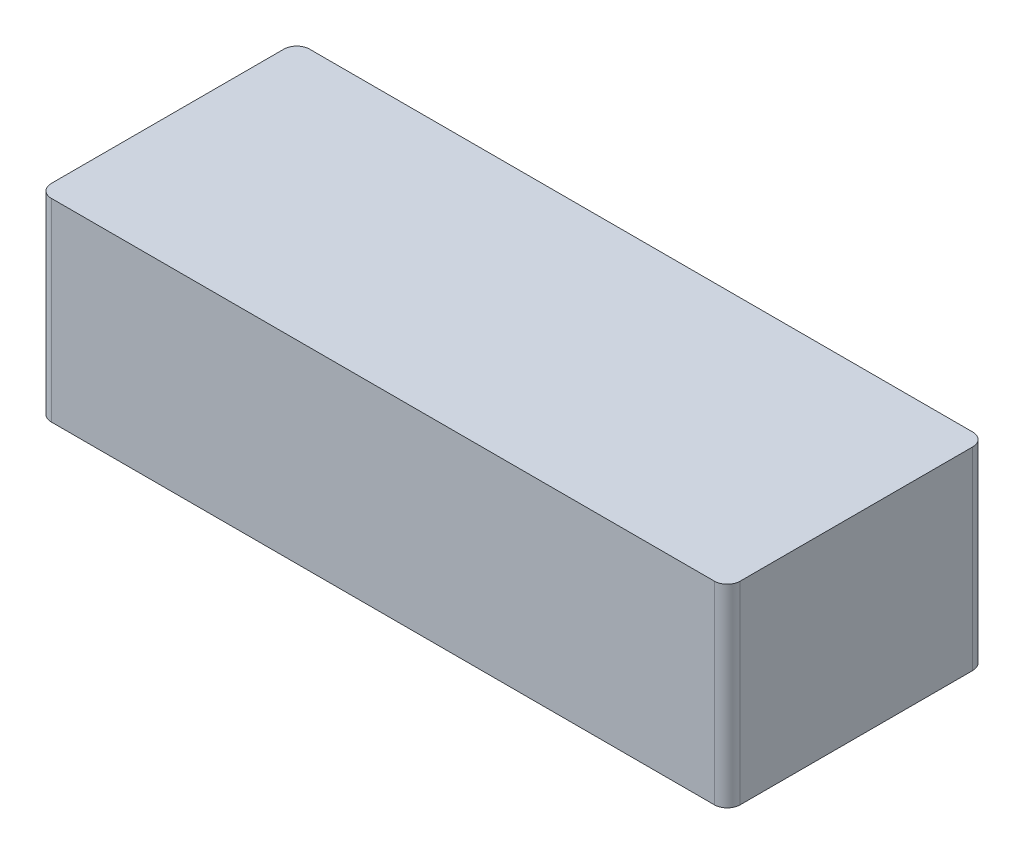
ISO-10303-21;
HEADER;
FILE_DESCRIPTION(('STEP AP214'),'2;1');
FILE_NAME('part.step','',(''),(''),'','','');
FILE_SCHEMA(('AUTOMOTIVE_DESIGN { 1 0 10303 214 1 1 1 1 }'));
ENDSEC;
DATA;
#1=APPLICATION_CONTEXT('core data for automotive mechanical design processes');
#2=APPLICATION_PROTOCOL_DEFINITION('international standard','automotive_design',2000,#1);
#3=PRODUCT_CONTEXT('',#1,'mechanical');
#4=PRODUCT('Part','Part','',(#3));
#5=PRODUCT_RELATED_PRODUCT_CATEGORY('part','',(#4));
#6=PRODUCT_DEFINITION_FORMATION('','',#4);
#7=PRODUCT_DEFINITION_CONTEXT('part definition',#1,'design');
#8=PRODUCT_DEFINITION('design','',#6,#7);
#9=PRODUCT_DEFINITION_SHAPE('','',#8);
#10=(LENGTH_UNIT() NAMED_UNIT(*) SI_UNIT(.MILLI.,.METRE.));
#11=(NAMED_UNIT(*) PLANE_ANGLE_UNIT() SI_UNIT($,.RADIAN.));
#12=(NAMED_UNIT(*) SI_UNIT($,.STERADIAN.) SOLID_ANGLE_UNIT());
#13=UNCERTAINTY_MEASURE_WITH_UNIT(LENGTH_MEASURE(1.E-05),#10,'distance_accuracy_value','');
#14=(GEOMETRIC_REPRESENTATION_CONTEXT(3) GLOBAL_UNCERTAINTY_ASSIGNED_CONTEXT((#13)) GLOBAL_UNIT_ASSIGNED_CONTEXT((#10,
#11,#12)) REPRESENTATION_CONTEXT('',''));
#15=CARTESIAN_POINT('',(0.,0.,0.));
#16=DIRECTION('',(0.,0.,1.));
#17=DIRECTION('',(1.,0.,0.));
#18=AXIS2_PLACEMENT_3D('',#15,#16,#17);
#19=CARTESIAN_POINT('',(-154.,90.,-60.));
#20=DIRECTION('',(0.,0.,-1.));
#21=DIRECTION('',(-1.,0.,0.));
#22=AXIS2_PLACEMENT_3D('',#19,#20,#21);
#23=PLANE('',#22);
#24=DIRECTION('',(1.,0.,0.));
#25=VECTOR('',#24,1.);
#26=CARTESIAN_POINT('',(-154.,0.,-60.));
#27=LINE('',#26,#25);
#28=CARTESIAN_POINT('',(-154.,0.,-60.));
#29=VERTEX_POINT('',#28);
#30=CARTESIAN_POINT('',(154.,0.,-60.));
#31=VERTEX_POINT('',#30);
#32=EDGE_CURVE('E136',#29,#31,#27,.T.);
#33=ORIENTED_EDGE('',*,*,#32,.F.);
#34=DIRECTION('',(0.,-1.,0.));
#35=VECTOR('',#34,1.);
#36=CARTESIAN_POINT('',(-154.,90.,-60.));
#37=LINE('',#36,#35);
#38=CARTESIAN_POINT('',(-154.,90.,-60.));
#39=VERTEX_POINT('',#38);
#40=EDGE_CURVE('E11',#39,#29,#37,.T.);
#41=ORIENTED_EDGE('',*,*,#40,.F.);
#42=DIRECTION('',(1.,0.,0.));
#43=VECTOR('',#42,1.);
#44=CARTESIAN_POINT('',(-154.,90.,-60.));
#45=LINE('',#44,#43);
#46=CARTESIAN_POINT('',(154.,90.,-60.));
#47=VERTEX_POINT('',#46);
#48=EDGE_CURVE('E155',#39,#47,#45,.T.);
#49=ORIENTED_EDGE('',*,*,#48,.T.);
#50=DIRECTION('',(0.,-1.,0.));
#51=VECTOR('',#50,1.);
#52=CARTESIAN_POINT('',(154.,90.,-60.));
#53=LINE('',#52,#51);
#54=EDGE_CURVE('E39',#47,#31,#53,.T.);
#55=ORIENTED_EDGE('',*,*,#54,.T.);
#56=EDGE_LOOP('',(#33,#41,#49,#55));
#57=FACE_BOUND('',#56,.T.);
#58=ADVANCED_FACE('F36',(#57),#23,.T.);
#59=CARTESIAN_POINT('',(-154.,90.,-54.));
#60=DIRECTION('',(0.,-1.,0.));
#61=DIRECTION('',(0.,0.,-1.));
#62=AXIS2_PLACEMENT_3D('',#59,#60,#61);
#63=CYLINDRICAL_SURFACE('',#62,6.);
#64=CARTESIAN_POINT('',(-154.,0.,-54.));
#65=DIRECTION('',(0.,-1.,0.));
#66=DIRECTION('',(0.,0.,-1.));
#67=AXIS2_PLACEMENT_3D('',#64,#65,#66);
#68=CIRCLE('',#67,6.);
#69=CARTESIAN_POINT('',(-160.,0.,-54.));
#70=VERTEX_POINT('',#69);
#71=EDGE_CURVE('E153',#70,#29,#68,.T.);
#72=ORIENTED_EDGE('',*,*,#71,.F.);
#73=DIRECTION('',(0.,-1.,0.));
#74=VECTOR('',#73,1.);
#75=CARTESIAN_POINT('',(-160.,90.,-54.));
#76=LINE('',#75,#74);
#77=CARTESIAN_POINT('',(-160.,90.,-54.));
#78=VERTEX_POINT('',#77);
#79=EDGE_CURVE('E45',#78,#70,#76,.T.);
#80=ORIENTED_EDGE('',*,*,#79,.F.);
#81=CARTESIAN_POINT('',(-154.,90.,-54.));
#82=DIRECTION('',(0.,-1.,0.));
#83=DIRECTION('',(0.,0.,-1.));
#84=AXIS2_PLACEMENT_3D('',#81,#82,#83);
#85=CIRCLE('',#84,6.);
#86=EDGE_CURVE('E125',#78,#39,#85,.T.);
#87=ORIENTED_EDGE('',*,*,#86,.T.);
#88=ORIENTED_EDGE('',*,*,#40,.T.);
#89=EDGE_LOOP('',(#72,#80,#87,#88));
#90=FACE_BOUND('',#89,.T.);
#91=ADVANCED_FACE('F170',(#90),#63,.T.);
#92=CARTESIAN_POINT('',(-160.,90.,54.));
#93=DIRECTION('',(-1.,0.,0.));
#94=DIRECTION('',(0.,0.,1.));
#95=AXIS2_PLACEMENT_3D('',#92,#93,#94);
#96=PLANE('',#95);
#97=DIRECTION('',(0.,0.,-1.));
#98=VECTOR('',#97,1.);
#99=CARTESIAN_POINT('',(-160.,0.,54.));
#100=LINE('',#99,#98);
#101=CARTESIAN_POINT('',(-160.,0.,54.));
#102=VERTEX_POINT('',#101);
#103=EDGE_CURVE('E114',#102,#70,#100,.T.);
#104=ORIENTED_EDGE('',*,*,#103,.F.);
#105=DIRECTION('',(0.,-1.,0.));
#106=VECTOR('',#105,1.);
#107=CARTESIAN_POINT('',(-160.,90.,54.));
#108=LINE('',#107,#106);
#109=CARTESIAN_POINT('',(-160.,90.,54.));
#110=VERTEX_POINT('',#109);
#111=EDGE_CURVE('E109',#110,#102,#108,.T.);
#112=ORIENTED_EDGE('',*,*,#111,.F.);
#113=DIRECTION('',(0.,0.,-1.));
#114=VECTOR('',#113,1.);
#115=CARTESIAN_POINT('',(-160.,90.,54.));
#116=LINE('',#115,#114);
#117=EDGE_CURVE('E112',#110,#78,#116,.T.);
#118=ORIENTED_EDGE('',*,*,#117,.T.);
#119=ORIENTED_EDGE('',*,*,#79,.T.);
#120=EDGE_LOOP('',(#104,#112,#118,#119));
#121=FACE_BOUND('',#120,.T.);
#122=ADVANCED_FACE('F111',(#121),#96,.T.);
#123=CARTESIAN_POINT('',(-154.,90.,54.));
#124=DIRECTION('',(0.,-1.,0.));
#125=DIRECTION('',(0.,0.,-1.));
#126=AXIS2_PLACEMENT_3D('',#123,#124,#125);
#127=CYLINDRICAL_SURFACE('',#126,6.);
#128=CARTESIAN_POINT('',(-154.,0.,54.));
#129=DIRECTION('',(0.,-1.,0.));
#130=DIRECTION('',(0.,0.,-1.));
#131=AXIS2_PLACEMENT_3D('',#128,#129,#130);
#132=CIRCLE('',#131,6.);
#133=CARTESIAN_POINT('',(-154.,0.,60.));
#134=VERTEX_POINT('',#133);
#135=EDGE_CURVE('E150',#134,#102,#132,.T.);
#136=ORIENTED_EDGE('',*,*,#135,.F.);
#137=DIRECTION('',(0.,-1.,0.));
#138=VECTOR('',#137,1.);
#139=CARTESIAN_POINT('',(-154.,90.,60.));
#140=LINE('',#139,#138);
#141=CARTESIAN_POINT('',(-154.,90.,60.));
#142=VERTEX_POINT('',#141);
#143=EDGE_CURVE('E119',#142,#134,#140,.T.);
#144=ORIENTED_EDGE('',*,*,#143,.F.);
#145=CARTESIAN_POINT('',(-154.,90.,54.));
#146=DIRECTION('',(0.,-1.,0.));
#147=DIRECTION('',(0.,0.,-1.));
#148=AXIS2_PLACEMENT_3D('',#145,#146,#147);
#149=CIRCLE('',#148,6.);
#150=EDGE_CURVE('E124',#142,#110,#149,.T.);
#151=ORIENTED_EDGE('',*,*,#150,.T.);
#152=ORIENTED_EDGE('',*,*,#111,.T.);
#153=EDGE_LOOP('',(#136,#144,#151,#152));
#154=FACE_BOUND('',#153,.T.);
#155=ADVANCED_FACE('F127',(#154),#127,.T.);
#156=CARTESIAN_POINT('',(-154.,90.,60.));
#157=DIRECTION('',(0.,0.,-1.));
#158=DIRECTION('',(-1.,0.,0.));
#159=AXIS2_PLACEMENT_3D('',#156,#157,#158);
#160=PLANE('',#159);
#161=DIRECTION('',(1.,0.,0.));
#162=VECTOR('',#161,1.);
#163=CARTESIAN_POINT('',(-154.,0.,60.));
#164=LINE('',#163,#162);
#165=CARTESIAN_POINT('',(154.,0.,60.));
#166=VERTEX_POINT('',#165);
#167=EDGE_CURVE('E148',#134,#166,#164,.T.);
#168=ORIENTED_EDGE('',*,*,#167,.T.);
#169=DIRECTION('',(0.,-1.,0.));
#170=VECTOR('',#169,1.);
#171=CARTESIAN_POINT('',(154.,90.,60.));
#172=LINE('',#171,#170);
#173=CARTESIAN_POINT('',(154.,90.,60.));
#174=VERTEX_POINT('',#173);
#175=EDGE_CURVE('E159',#174,#166,#172,.T.);
#176=ORIENTED_EDGE('',*,*,#175,.F.);
#177=DIRECTION('',(1.,0.,0.));
#178=VECTOR('',#177,1.);
#179=CARTESIAN_POINT('',(-154.,90.,60.));
#180=LINE('',#179,#178);
#181=EDGE_CURVE('E129',#142,#174,#180,.T.);
#182=ORIENTED_EDGE('',*,*,#181,.F.);
#183=ORIENTED_EDGE('',*,*,#143,.T.);
#184=EDGE_LOOP('',(#168,#176,#182,#183));
#185=FACE_BOUND('',#184,.T.);
#186=ADVANCED_FACE('F183',(#185),#160,.F.);
#187=CARTESIAN_POINT('',(154.,90.,54.));
#188=DIRECTION('',(0.,-1.,0.));
#189=DIRECTION('',(0.,0.,-1.));
#190=AXIS2_PLACEMENT_3D('',#187,#188,#189);
#191=CYLINDRICAL_SURFACE('',#190,6.);
#192=CARTESIAN_POINT('',(154.,0.,54.));
#193=DIRECTION('',(0.,1.,0.));
#194=DIRECTION('',(0.,0.,1.));
#195=AXIS2_PLACEMENT_3D('',#192,#193,#194);
#196=CIRCLE('',#195,6.);
#197=CARTESIAN_POINT('',(160.,0.,54.));
#198=VERTEX_POINT('',#197);
#199=EDGE_CURVE('E146',#166,#198,#196,.T.);
#200=ORIENTED_EDGE('',*,*,#199,.T.);
#201=DIRECTION('',(0.,-1.,0.));
#202=VECTOR('',#201,1.);
#203=CARTESIAN_POINT('',(160.,90.,54.));
#204=LINE('',#203,#202);
#205=CARTESIAN_POINT('',(160.,90.,54.));
#206=VERTEX_POINT('',#205);
#207=EDGE_CURVE('E162',#206,#198,#204,.T.);
#208=ORIENTED_EDGE('',*,*,#207,.F.);
#209=CARTESIAN_POINT('',(154.,90.,54.));
#210=DIRECTION('',(0.,1.,0.));
#211=DIRECTION('',(0.,0.,1.));
#212=AXIS2_PLACEMENT_3D('',#209,#210,#211);
#213=CIRCLE('',#212,6.);
#214=EDGE_CURVE('E131',#174,#206,#213,.T.);
#215=ORIENTED_EDGE('',*,*,#214,.F.);
#216=ORIENTED_EDGE('',*,*,#175,.T.);
#217=EDGE_LOOP('',(#200,#208,#215,#216));
#218=FACE_BOUND('',#217,.T.);
#219=ADVANCED_FACE('F186',(#218),#191,.T.);
#220=CARTESIAN_POINT('',(160.,90.,54.));
#221=DIRECTION('',(-1.,0.,0.));
#222=DIRECTION('',(0.,0.,1.));
#223=AXIS2_PLACEMENT_3D('',#220,#221,#222);
#224=PLANE('',#223);
#225=DIRECTION('',(0.,0.,-1.));
#226=VECTOR('',#225,1.);
#227=CARTESIAN_POINT('',(160.,0.,54.));
#228=LINE('',#227,#226);
#229=CARTESIAN_POINT('',(160.,0.,-54.));
#230=VERTEX_POINT('',#229);
#231=EDGE_CURVE('E143',#198,#230,#228,.T.);
#232=ORIENTED_EDGE('',*,*,#231,.T.);
#233=DIRECTION('',(0.,-1.,0.));
#234=VECTOR('',#233,1.);
#235=CARTESIAN_POINT('',(160.,90.,-54.));
#236=LINE('',#235,#234);
#237=CARTESIAN_POINT('',(160.,90.,-54.));
#238=VERTEX_POINT('',#237);
#239=EDGE_CURVE('E164',#238,#230,#236,.T.);
#240=ORIENTED_EDGE('',*,*,#239,.F.);
#241=DIRECTION('',(0.,0.,-1.));
#242=VECTOR('',#241,1.);
#243=CARTESIAN_POINT('',(160.,90.,54.));
#244=LINE('',#243,#242);
#245=EDGE_CURVE('E328',#206,#238,#244,.T.);
#246=ORIENTED_EDGE('',*,*,#245,.F.);
#247=ORIENTED_EDGE('',*,*,#207,.T.);
#248=EDGE_LOOP('',(#232,#240,#246,#247));
#249=FACE_BOUND('',#248,.T.);
#250=ADVANCED_FACE('F190',(#249),#224,.F.);
#251=CARTESIAN_POINT('',(154.,90.,-54.));
#252=DIRECTION('',(0.,-1.,0.));
#253=DIRECTION('',(0.,0.,-1.));
#254=AXIS2_PLACEMENT_3D('',#251,#252,#253);
#255=CYLINDRICAL_SURFACE('',#254,6.);
#256=CARTESIAN_POINT('',(154.,0.,-54.));
#257=DIRECTION('',(0.,-1.,0.));
#258=DIRECTION('',(0.,0.,-1.));
#259=AXIS2_PLACEMENT_3D('',#256,#257,#258);
#260=CIRCLE('',#259,6.);
#261=EDGE_CURVE('E139',#31,#230,#260,.T.);
#262=ORIENTED_EDGE('',*,*,#261,.F.);
#263=ORIENTED_EDGE('',*,*,#54,.F.);
#264=CARTESIAN_POINT('',(154.,90.,-54.));
#265=DIRECTION('',(0.,-1.,0.));
#266=DIRECTION('',(0.,0.,-1.));
#267=AXIS2_PLACEMENT_3D('',#264,#265,#266);
#268=CIRCLE('',#267,6.);
#269=EDGE_CURVE('E326',#47,#238,#268,.T.);
#270=ORIENTED_EDGE('',*,*,#269,.T.);
#271=ORIENTED_EDGE('',*,*,#239,.T.);
#272=EDGE_LOOP('',(#262,#263,#270,#271));
#273=FACE_BOUND('',#272,.T.);
#274=ADVANCED_FACE('F166',(#273),#255,.T.);
#275=CARTESIAN_POINT('',(154.,90.,-54.));
#276=DIRECTION('',(0.,-1.,0.));
#277=DIRECTION('',(0.,0.,-1.));
#278=AXIS2_PLACEMENT_3D('',#275,#276,#277);
#279=PLANE('',#278);
#280=ORIENTED_EDGE('',*,*,#48,.F.);
#281=ORIENTED_EDGE('',*,*,#86,.F.);
#282=ORIENTED_EDGE('',*,*,#117,.F.);
#283=ORIENTED_EDGE('',*,*,#150,.F.);
#284=ORIENTED_EDGE('',*,*,#181,.T.);
#285=ORIENTED_EDGE('',*,*,#214,.T.);
#286=ORIENTED_EDGE('',*,*,#245,.T.);
#287=ORIENTED_EDGE('',*,*,#269,.F.);
#288=EDGE_LOOP('',(#280,#281,#282,#283,#284,#285,#286,#287));
#289=FACE_BOUND('',#288,.T.);
#290=ADVANCED_FACE('F123',(#289),#279,.F.);
#291=CARTESIAN_POINT('',(154.,0.,-54.));
#292=DIRECTION('',(0.,-1.,0.));
#293=DIRECTION('',(0.,0.,-1.));
#294=AXIS2_PLACEMENT_3D('',#291,#292,#293);
#295=PLANE('',#294);
#296=ORIENTED_EDGE('',*,*,#32,.T.);
#297=ORIENTED_EDGE('',*,*,#261,.T.);
#298=ORIENTED_EDGE('',*,*,#231,.F.);
#299=ORIENTED_EDGE('',*,*,#199,.F.);
#300=ORIENTED_EDGE('',*,*,#167,.F.);
#301=ORIENTED_EDGE('',*,*,#135,.T.);
#302=ORIENTED_EDGE('',*,*,#103,.T.);
#303=ORIENTED_EDGE('',*,*,#71,.T.);
#304=EDGE_LOOP('',(#296,#297,#298,#299,#300,#301,#302,#303));
#305=FACE_BOUND('',#304,.T.);
#306=ADVANCED_FACE('F169',(#305),#295,.T.);
#307=CLOSED_SHELL('',(#58,#91,#122,#155,#186,#219,#250,#274,#290,#306));
#308=CARTESIAN_POINT('',(154.,88.5,-55.));
#309=DIRECTION('',(0.,0.,-1.));
#310=DIRECTION('',(-1.,0.,0.));
#311=AXIS2_PLACEMENT_3D('',#308,#309,#310);
#312=PLANE('',#311);
#313=DIRECTION('',(1.,0.,0.));
#314=VECTOR('',#313,1.);
#315=CARTESIAN_POINT('',(154.,1.5,-55.));
#316=LINE('',#315,#314);
#317=CARTESIAN_POINT('',(-154.,1.5,-55.));
#318=VERTEX_POINT('',#317);
#319=CARTESIAN_POINT('',(154.,1.5,-55.));
#320=VERTEX_POINT('',#319);
#321=EDGE_CURVE('E284',#318,#320,#316,.T.);
#322=ORIENTED_EDGE('',*,*,#321,.T.);
#323=DIRECTION('',(0.,-1.,0.));
#324=VECTOR('',#323,1.);
#325=CARTESIAN_POINT('',(154.,88.5,-55.));
#326=LINE('',#325,#324);
#327=CARTESIAN_POINT('',(154.,88.5,-55.));
#328=VERTEX_POINT('',#327);
#329=EDGE_CURVE('E283',#328,#320,#326,.T.);
#330=ORIENTED_EDGE('',*,*,#329,.F.);
#331=DIRECTION('',(1.,0.,0.));
#332=VECTOR('',#331,1.);
#333=CARTESIAN_POINT('',(154.,88.5,-55.));
#334=LINE('',#333,#332);
#335=CARTESIAN_POINT('',(-154.,88.5,-55.));
#336=VERTEX_POINT('',#335);
#337=EDGE_CURVE('E250',#336,#328,#334,.T.);
#338=ORIENTED_EDGE('',*,*,#337,.F.);
#339=DIRECTION('',(0.,-1.,0.));
#340=VECTOR('',#339,1.);
#341=CARTESIAN_POINT('',(-154.,88.5,-55.));
#342=LINE('',#341,#340);
#343=EDGE_CURVE('E140',#336,#318,#342,.T.);
#344=ORIENTED_EDGE('',*,*,#343,.T.);
#345=EDGE_LOOP('',(#322,#330,#338,#344));
#346=FACE_BOUND('',#345,.T.);
#347=ADVANCED_FACE('F202',(#346),#312,.F.);
#348=CARTESIAN_POINT('',(-154.,88.5,-54.));
#349=DIRECTION('',(0.,-1.,0.));
#350=DIRECTION('',(0.,0.,-1.));
#351=AXIS2_PLACEMENT_3D('',#348,#349,#350);
#352=CYLINDRICAL_SURFACE('',#351,1.);
#353=CARTESIAN_POINT('',(-154.,1.5,-54.));
#354=DIRECTION('',(0.,-1.,0.));
#355=DIRECTION('',(-1.,0.,0.));
#356=AXIS2_PLACEMENT_3D('',#353,#354,#355);
#357=CIRCLE('',#356,1.);
#358=CARTESIAN_POINT('',(-155.,1.5,-54.));
#359=VERTEX_POINT('',#358);
#360=EDGE_CURVE('E261',#359,#318,#357,.T.);
#361=ORIENTED_EDGE('',*,*,#360,.T.);
#362=ORIENTED_EDGE('',*,*,#343,.F.);
#363=CARTESIAN_POINT('',(-154.,88.5,-54.));
#364=DIRECTION('',(0.,-1.,0.));
#365=DIRECTION('',(-1.,0.,0.));
#366=AXIS2_PLACEMENT_3D('',#363,#364,#365);
#367=CIRCLE('',#366,1.);
#368=CARTESIAN_POINT('',(-155.,88.5,-54.));
#369=VERTEX_POINT('',#368);
#370=EDGE_CURVE('E257',#369,#336,#367,.T.);
#371=ORIENTED_EDGE('',*,*,#370,.F.);
#372=DIRECTION('',(0.,-1.,0.));
#373=VECTOR('',#372,1.);
#374=CARTESIAN_POINT('',(-155.,88.5,-54.));
#375=LINE('',#374,#373);
#376=EDGE_CURVE('E305',#369,#359,#375,.T.);
#377=ORIENTED_EDGE('',*,*,#376,.T.);
#378=EDGE_LOOP('',(#361,#362,#371,#377));
#379=FACE_BOUND('',#378,.T.);
#380=ADVANCED_FACE('F205',(#379),#352,.F.);
#381=CARTESIAN_POINT('',(-155.,88.5,-54.));
#382=DIRECTION('',(-1.,0.,0.));
#383=DIRECTION('',(0.,0.,1.));
#384=AXIS2_PLACEMENT_3D('',#381,#382,#383);
#385=PLANE('',#384);
#386=DIRECTION('',(0.,0.,-1.));
#387=VECTOR('',#386,1.);
#388=CARTESIAN_POINT('',(-155.,1.5,-54.));
#389=LINE('',#388,#387);
#390=CARTESIAN_POINT('',(-155.,1.5,54.));
#391=VERTEX_POINT('',#390);
#392=EDGE_CURVE('E266',#391,#359,#389,.T.);
#393=ORIENTED_EDGE('',*,*,#392,.T.);
#394=ORIENTED_EDGE('',*,*,#376,.F.);
#395=DIRECTION('',(0.,0.,-1.));
#396=VECTOR('',#395,1.);
#397=CARTESIAN_POINT('',(-155.,88.5,-54.));
#398=LINE('',#397,#396);
#399=CARTESIAN_POINT('',(-155.,88.5,54.));
#400=VERTEX_POINT('',#399);
#401=EDGE_CURVE('E280',#400,#369,#398,.T.);
#402=ORIENTED_EDGE('',*,*,#401,.F.);
#403=DIRECTION('',(0.,-1.,0.));
#404=VECTOR('',#403,1.);
#405=CARTESIAN_POINT('',(-155.,88.5,54.));
#406=LINE('',#405,#404);
#407=EDGE_CURVE('E308',#400,#391,#406,.T.);
#408=ORIENTED_EDGE('',*,*,#407,.T.);
#409=EDGE_LOOP('',(#393,#394,#402,#408));
#410=FACE_BOUND('',#409,.T.);
#411=ADVANCED_FACE('F228',(#410),#385,.F.);
#412=CARTESIAN_POINT('',(-154.,88.5,54.));
#413=DIRECTION('',(0.,-1.,0.));
#414=DIRECTION('',(0.,0.,-1.));
#415=AXIS2_PLACEMENT_3D('',#412,#413,#414);
#416=CYLINDRICAL_SURFACE('',#415,1.);
#417=CARTESIAN_POINT('',(-154.,1.5,54.));
#418=DIRECTION('',(0.,-1.,0.));
#419=DIRECTION('',(-1.,0.,0.));
#420=AXIS2_PLACEMENT_3D('',#417,#418,#419);
#421=CIRCLE('',#420,1.);
#422=CARTESIAN_POINT('',(-154.,1.5,55.));
#423=VERTEX_POINT('',#422);
#424=EDGE_CURVE('E299',#423,#391,#421,.T.);
#425=ORIENTED_EDGE('',*,*,#424,.T.);
#426=ORIENTED_EDGE('',*,*,#407,.F.);
#427=CARTESIAN_POINT('',(-154.,88.5,54.));
#428=DIRECTION('',(0.,-1.,0.));
#429=DIRECTION('',(-1.,0.,0.));
#430=AXIS2_PLACEMENT_3D('',#427,#428,#429);
#431=CIRCLE('',#430,1.);
#432=CARTESIAN_POINT('',(-154.,88.5,55.));
#433=VERTEX_POINT('',#432);
#434=EDGE_CURVE('E277',#433,#400,#431,.T.);
#435=ORIENTED_EDGE('',*,*,#434,.F.);
#436=DIRECTION('',(0.,-1.,0.));
#437=VECTOR('',#436,1.);
#438=CARTESIAN_POINT('',(-154.,88.5,55.));
#439=LINE('',#438,#437);
#440=EDGE_CURVE('E311',#433,#423,#439,.T.);
#441=ORIENTED_EDGE('',*,*,#440,.T.);
#442=EDGE_LOOP('',(#425,#426,#435,#441));
#443=FACE_BOUND('',#442,.T.);
#444=ADVANCED_FACE('F224',(#443),#416,.F.);
#445=CARTESIAN_POINT('',(154.,88.5,55.));
#446=DIRECTION('',(0.,0.,-1.));
#447=DIRECTION('',(-1.,0.,0.));
#448=AXIS2_PLACEMENT_3D('',#445,#446,#447);
#449=PLANE('',#448);
#450=DIRECTION('',(1.,0.,0.));
#451=VECTOR('',#450,1.);
#452=CARTESIAN_POINT('',(154.,1.5,55.));
#453=LINE('',#452,#451);
#454=CARTESIAN_POINT('',(154.,1.5,55.));
#455=VERTEX_POINT('',#454);
#456=EDGE_CURVE('E296',#423,#455,#453,.T.);
#457=ORIENTED_EDGE('',*,*,#456,.F.);
#458=ORIENTED_EDGE('',*,*,#440,.F.);
#459=DIRECTION('',(1.,0.,0.));
#460=VECTOR('',#459,1.);
#461=CARTESIAN_POINT('',(154.,88.5,55.));
#462=LINE('',#461,#460);
#463=CARTESIAN_POINT('',(154.,88.5,55.));
#464=VERTEX_POINT('',#463);
#465=EDGE_CURVE('E274',#433,#464,#462,.T.);
#466=ORIENTED_EDGE('',*,*,#465,.T.);
#467=DIRECTION('',(0.,-1.,0.));
#468=VECTOR('',#467,1.);
#469=CARTESIAN_POINT('',(154.,88.5,55.));
#470=LINE('',#469,#468);
#471=EDGE_CURVE('E314',#464,#455,#470,.T.);
#472=ORIENTED_EDGE('',*,*,#471,.T.);
#473=EDGE_LOOP('',(#457,#458,#466,#472));
#474=FACE_BOUND('',#473,.T.);
#475=ADVANCED_FACE('F220',(#474),#449,.T.);
#476=CARTESIAN_POINT('',(154.,88.5,54.));
#477=DIRECTION('',(0.,-1.,0.));
#478=DIRECTION('',(0.,0.,-1.));
#479=AXIS2_PLACEMENT_3D('',#476,#477,#478);
#480=CYLINDRICAL_SURFACE('',#479,1.);
#481=CARTESIAN_POINT('',(154.,1.5,54.));
#482=DIRECTION('',(0.,-1.,0.));
#483=DIRECTION('',(-1.,0.,0.));
#484=AXIS2_PLACEMENT_3D('',#481,#482,#483);
#485=CIRCLE('',#484,1.);
#486=CARTESIAN_POINT('',(155.,1.5,54.));
#487=VERTEX_POINT('',#486);
#488=EDGE_CURVE('E293',#455,#487,#485,.F.);
#489=ORIENTED_EDGE('',*,*,#488,.F.);
#490=ORIENTED_EDGE('',*,*,#471,.F.);
#491=CARTESIAN_POINT('',(154.,88.5,54.));
#492=DIRECTION('',(0.,-1.,0.));
#493=DIRECTION('',(-1.,0.,0.));
#494=AXIS2_PLACEMENT_3D('',#491,#492,#493);
#495=CIRCLE('',#494,1.);
#496=CARTESIAN_POINT('',(155.,88.5,54.));
#497=VERTEX_POINT('',#496);
#498=EDGE_CURVE('E271',#464,#497,#495,.F.);
#499=ORIENTED_EDGE('',*,*,#498,.T.);
#500=DIRECTION('',(0.,-1.,0.));
#501=VECTOR('',#500,1.);
#502=CARTESIAN_POINT('',(155.,88.5,54.));
#503=LINE('',#502,#501);
#504=EDGE_CURVE('E317',#497,#487,#503,.T.);
#505=ORIENTED_EDGE('',*,*,#504,.T.);
#506=EDGE_LOOP('',(#489,#490,#499,#505));
#507=FACE_BOUND('',#506,.T.);
#508=ADVANCED_FACE('F216',(#507),#480,.F.);
#509=CARTESIAN_POINT('',(155.,88.5,-54.));
#510=DIRECTION('',(-1.,0.,0.));
#511=DIRECTION('',(0.,0.,1.));
#512=AXIS2_PLACEMENT_3D('',#509,#510,#511);
#513=PLANE('',#512);
#514=DIRECTION('',(0.,0.,-1.));
#515=VECTOR('',#514,1.);
#516=CARTESIAN_POINT('',(155.,1.5,-54.));
#517=LINE('',#516,#515);
#518=CARTESIAN_POINT('',(155.,1.5,-54.));
#519=VERTEX_POINT('',#518);
#520=EDGE_CURVE('E290',#487,#519,#517,.T.);
#521=ORIENTED_EDGE('',*,*,#520,.F.);
#522=ORIENTED_EDGE('',*,*,#504,.F.);
#523=DIRECTION('',(0.,0.,-1.));
#524=VECTOR('',#523,1.);
#525=CARTESIAN_POINT('',(155.,88.5,-54.));
#526=LINE('',#525,#524);
#527=CARTESIAN_POINT('',(155.,88.5,-54.));
#528=VERTEX_POINT('',#527);
#529=EDGE_CURVE('E263',#497,#528,#526,.T.);
#530=ORIENTED_EDGE('',*,*,#529,.T.);
#531=DIRECTION('',(0.,-1.,0.));
#532=VECTOR('',#531,1.);
#533=CARTESIAN_POINT('',(155.,88.5,-54.));
#534=LINE('',#533,#532);
#535=EDGE_CURVE('E320',#528,#519,#534,.T.);
#536=ORIENTED_EDGE('',*,*,#535,.T.);
#537=EDGE_LOOP('',(#521,#522,#530,#536));
#538=FACE_BOUND('',#537,.T.);
#539=ADVANCED_FACE('F212',(#538),#513,.T.);
#540=CARTESIAN_POINT('',(154.,88.5,-54.));
#541=DIRECTION('',(0.,-1.,0.));
#542=DIRECTION('',(0.,0.,-1.));
#543=AXIS2_PLACEMENT_3D('',#540,#541,#542);
#544=CYLINDRICAL_SURFACE('',#543,1.);
#545=CARTESIAN_POINT('',(154.,1.5,-54.));
#546=DIRECTION('',(0.,-1.,0.));
#547=DIRECTION('',(-1.,0.,0.));
#548=AXIS2_PLACEMENT_3D('',#545,#546,#547);
#549=CIRCLE('',#548,1.);
#550=EDGE_CURVE('E287',#320,#519,#549,.T.);
#551=ORIENTED_EDGE('',*,*,#550,.T.);
#552=ORIENTED_EDGE('',*,*,#535,.F.);
#553=CARTESIAN_POINT('',(154.,88.5,-54.));
#554=DIRECTION('',(0.,-1.,0.));
#555=DIRECTION('',(-1.,0.,0.));
#556=AXIS2_PLACEMENT_3D('',#553,#554,#555);
#557=CIRCLE('',#556,1.);
#558=EDGE_CURVE('E254',#328,#528,#557,.T.);
#559=ORIENTED_EDGE('',*,*,#558,.F.);
#560=ORIENTED_EDGE('',*,*,#329,.T.);
#561=EDGE_LOOP('',(#551,#552,#559,#560));
#562=FACE_BOUND('',#561,.T.);
#563=ADVANCED_FACE('F208',(#562),#544,.F.);
#564=CARTESIAN_POINT('',(154.,88.5,-54.));
#565=DIRECTION('',(0.,-1.,0.));
#566=DIRECTION('',(0.,0.,-1.));
#567=AXIS2_PLACEMENT_3D('',#564,#565,#566);
#568=PLANE('',#567);
#569=ORIENTED_EDGE('',*,*,#337,.T.);
#570=ORIENTED_EDGE('',*,*,#558,.T.);
#571=ORIENTED_EDGE('',*,*,#529,.F.);
#572=ORIENTED_EDGE('',*,*,#498,.F.);
#573=ORIENTED_EDGE('',*,*,#465,.F.);
#574=ORIENTED_EDGE('',*,*,#434,.T.);
#575=ORIENTED_EDGE('',*,*,#401,.T.);
#576=ORIENTED_EDGE('',*,*,#370,.T.);
#577=EDGE_LOOP('',(#569,#570,#571,#572,#573,#574,#575,#576));
#578=FACE_BOUND('',#577,.T.);
#579=ADVANCED_FACE('F211',(#578),#568,.T.);
#580=CARTESIAN_POINT('',(154.,1.5,-54.));
#581=DIRECTION('',(0.,-1.,0.));
#582=DIRECTION('',(0.,0.,-1.));
#583=AXIS2_PLACEMENT_3D('',#580,#581,#582);
#584=PLANE('',#583);
#585=ORIENTED_EDGE('',*,*,#321,.F.);
#586=ORIENTED_EDGE('',*,*,#360,.F.);
#587=ORIENTED_EDGE('',*,*,#392,.F.);
#588=ORIENTED_EDGE('',*,*,#424,.F.);
#589=ORIENTED_EDGE('',*,*,#456,.T.);
#590=ORIENTED_EDGE('',*,*,#488,.T.);
#591=ORIENTED_EDGE('',*,*,#520,.T.);
#592=ORIENTED_EDGE('',*,*,#550,.F.);
#593=EDGE_LOOP('',(#585,#586,#587,#588,#589,#590,#591,#592));
#594=FACE_BOUND('',#593,.T.);
#595=ADVANCED_FACE('F236',(#594),#584,.F.);
#596=CLOSED_SHELL('',(#347,#380,#411,#444,#475,#508,#539,#563,#579,#595));
#597=ORIENTED_CLOSED_SHELL('',*,#596,.T.);
#598=BREP_WITH_VOIDS('B2',#307,(#597));
#599=ADVANCED_BREP_SHAPE_REPRESENTATION('',(#18,#598),#14);
#600=SHAPE_DEFINITION_REPRESENTATION(#9,#599);
ENDSEC;
END-ISO-10303-21;
